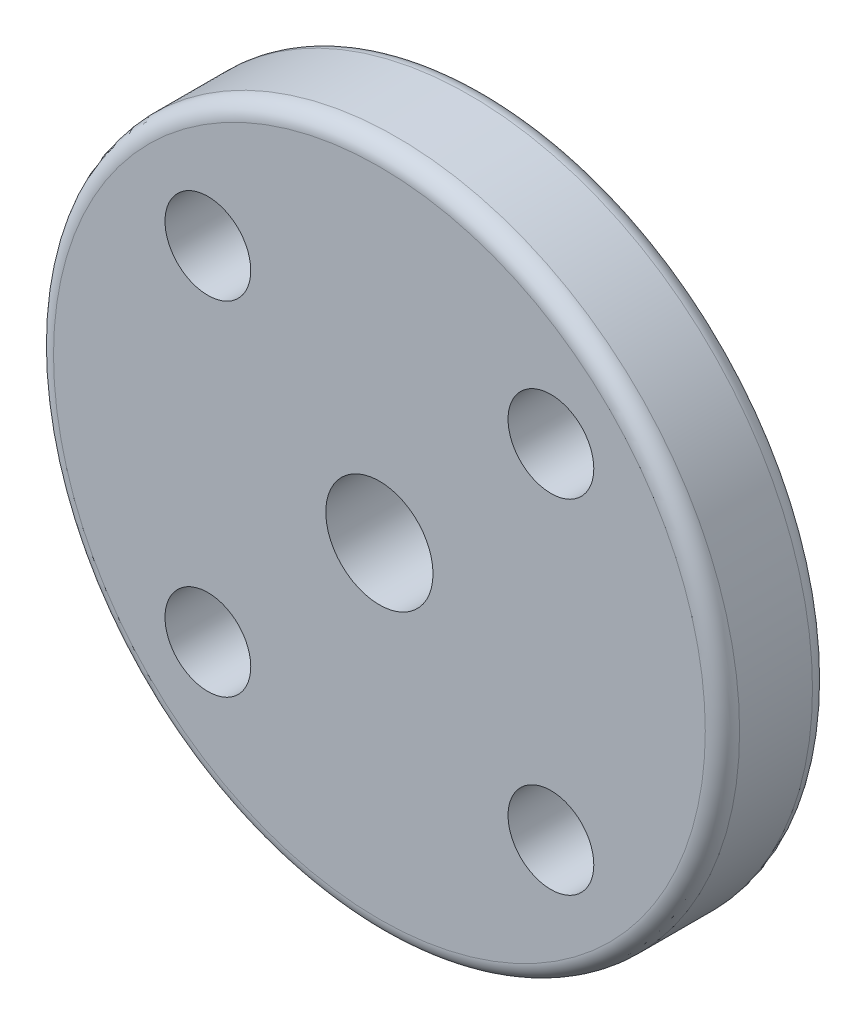
ISO-10303-21;
HEADER;
FILE_DESCRIPTION(('STEP AP214'),'2;1');
FILE_NAME('part.step','',(''),(''),'','','');
FILE_SCHEMA(('AUTOMOTIVE_DESIGN { 1 0 10303 214 1 1 1 1 }'));
ENDSEC;
DATA;
#1=APPLICATION_CONTEXT('core data for automotive mechanical design processes');
#2=APPLICATION_PROTOCOL_DEFINITION('international standard','automotive_design',2000,#1);
#3=PRODUCT_CONTEXT('',#1,'mechanical');
#4=PRODUCT('Part','Part','',(#3));
#5=PRODUCT_RELATED_PRODUCT_CATEGORY('part','',(#4));
#6=PRODUCT_DEFINITION_FORMATION('','',#4);
#7=PRODUCT_DEFINITION_CONTEXT('part definition',#1,'design');
#8=PRODUCT_DEFINITION('design','',#6,#7);
#9=PRODUCT_DEFINITION_SHAPE('','',#8);
#10=(LENGTH_UNIT() NAMED_UNIT(*) SI_UNIT(.MILLI.,.METRE.));
#11=(NAMED_UNIT(*) PLANE_ANGLE_UNIT() SI_UNIT($,.RADIAN.));
#12=(NAMED_UNIT(*) SI_UNIT($,.STERADIAN.) SOLID_ANGLE_UNIT());
#13=UNCERTAINTY_MEASURE_WITH_UNIT(LENGTH_MEASURE(1.E-05),#10,'distance_accuracy_value','');
#14=(GEOMETRIC_REPRESENTATION_CONTEXT(3) GLOBAL_UNCERTAINTY_ASSIGNED_CONTEXT((#13)) GLOBAL_UNIT_ASSIGNED_CONTEXT((#10,
#11,#12)) REPRESENTATION_CONTEXT('',''));
#15=CARTESIAN_POINT('',(0.,0.,0.));
#16=DIRECTION('',(0.,0.,1.));
#17=DIRECTION('',(1.,0.,0.));
#18=AXIS2_PLACEMENT_3D('',#15,#16,#17);
#19=CARTESIAN_POINT('',(0.,0.,5.));
#20=DIRECTION('',(0.,0.,-1.));
#21=DIRECTION('',(-1.,0.,0.));
#22=AXIS2_PLACEMENT_3D('',#19,#20,#21);
#23=CYLINDRICAL_SURFACE('',#22,16.);
#24=CARTESIAN_POINT('',(0.,0.,0.8));
#25=DIRECTION('',(0.,0.,1.));
#26=DIRECTION('',(1.,0.,0.));
#27=AXIS2_PLACEMENT_3D('',#24,#25,#26);
#28=CIRCLE('',#27,16.);
#29=CARTESIAN_POINT('',(16.,0.,0.8));
#30=VERTEX_POINT('',#29);
#31=EDGE_CURVE('E53',#30,#30,#28,.T.);
#32=ORIENTED_EDGE('',*,*,#31,.T.);
#33=EDGE_LOOP('',(#32));
#34=FACE_BOUND('',#33,.T.);
#35=CARTESIAN_POINT('',(0.,0.,4.2));
#36=DIRECTION('',(0.,0.,1.));
#37=DIRECTION('',(1.,0.,0.));
#38=AXIS2_PLACEMENT_3D('',#35,#36,#37);
#39=CIRCLE('',#38,16.);
#40=CARTESIAN_POINT('',(16.,0.,4.2));
#41=VERTEX_POINT('',#40);
#42=EDGE_CURVE('E57',#41,#41,#39,.F.);
#43=ORIENTED_EDGE('',*,*,#42,.T.);
#44=EDGE_LOOP('',(#43));
#45=FACE_BOUND('',#44,.T.);
#46=ADVANCED_FACE('F42',(#34,#45),#23,.T.);
#47=CARTESIAN_POINT('',(-8.,8.,5.));
#48=DIRECTION('',(0.,0.,-1.));
#49=DIRECTION('',(-1.,0.,0.));
#50=AXIS2_PLACEMENT_3D('',#47,#48,#49);
#51=CYLINDRICAL_SURFACE('',#50,2.);
#52=CARTESIAN_POINT('',(-8.,8.,5.));
#53=DIRECTION('',(0.,0.,1.));
#54=DIRECTION('',(1.,0.,0.));
#55=AXIS2_PLACEMENT_3D('',#52,#53,#54);
#56=CIRCLE('',#55,2.);
#57=CARTESIAN_POINT('',(-6.,8.,5.));
#58=VERTEX_POINT('',#57);
#59=EDGE_CURVE('E81',#58,#58,#56,.T.);
#60=ORIENTED_EDGE('',*,*,#59,.T.);
#61=EDGE_LOOP('',(#60));
#62=FACE_BOUND('',#61,.T.);
#63=CARTESIAN_POINT('',(-8.,8.,0.));
#64=DIRECTION('',(0.,0.,1.));
#65=DIRECTION('',(1.,0.,0.));
#66=AXIS2_PLACEMENT_3D('',#63,#64,#65);
#67=CIRCLE('',#66,2.);
#68=CARTESIAN_POINT('',(-6.,8.,0.));
#69=VERTEX_POINT('',#68);
#70=EDGE_CURVE('E67',#69,#69,#67,.T.);
#71=ORIENTED_EDGE('',*,*,#70,.F.);
#72=EDGE_LOOP('',(#71));
#73=FACE_BOUND('',#72,.T.);
#74=ADVANCED_FACE('F124',(#62,#73),#51,.F.);
#75=CARTESIAN_POINT('',(-8.,-8.,5.));
#76=DIRECTION('',(0.,0.,-1.));
#77=DIRECTION('',(-1.,0.,0.));
#78=AXIS2_PLACEMENT_3D('',#75,#76,#77);
#79=CYLINDRICAL_SURFACE('',#78,2.);
#80=CARTESIAN_POINT('',(-8.,-8.,5.));
#81=DIRECTION('',(0.,0.,1.));
#82=DIRECTION('',(1.,0.,0.));
#83=AXIS2_PLACEMENT_3D('',#80,#81,#82);
#84=CIRCLE('',#83,2.);
#85=CARTESIAN_POINT('',(-6.,-8.,5.));
#86=VERTEX_POINT('',#85);
#87=EDGE_CURVE('E84',#86,#86,#84,.T.);
#88=ORIENTED_EDGE('',*,*,#87,.T.);
#89=EDGE_LOOP('',(#88));
#90=FACE_BOUND('',#89,.T.);
#91=CARTESIAN_POINT('',(-8.,-8.,0.));
#92=DIRECTION('',(0.,0.,1.));
#93=DIRECTION('',(1.,0.,0.));
#94=AXIS2_PLACEMENT_3D('',#91,#92,#93);
#95=CIRCLE('',#94,2.);
#96=CARTESIAN_POINT('',(-6.,-8.,0.));
#97=VERTEX_POINT('',#96);
#98=EDGE_CURVE('E70',#97,#97,#95,.T.);
#99=ORIENTED_EDGE('',*,*,#98,.F.);
#100=EDGE_LOOP('',(#99));
#101=FACE_BOUND('',#100,.T.);
#102=ADVANCED_FACE('F130',(#90,#101),#79,.F.);
#103=CARTESIAN_POINT('',(8.,8.,5.));
#104=DIRECTION('',(0.,0.,-1.));
#105=DIRECTION('',(-1.,0.,0.));
#106=AXIS2_PLACEMENT_3D('',#103,#104,#105);
#107=CYLINDRICAL_SURFACE('',#106,2.);
#108=CARTESIAN_POINT('',(8.,8.,5.));
#109=DIRECTION('',(0.,0.,1.));
#110=DIRECTION('',(1.,0.,0.));
#111=AXIS2_PLACEMENT_3D('',#108,#109,#110);
#112=CIRCLE('',#111,2.);
#113=CARTESIAN_POINT('',(10.,8.,5.));
#114=VERTEX_POINT('',#113);
#115=EDGE_CURVE('E87',#114,#114,#112,.T.);
#116=ORIENTED_EDGE('',*,*,#115,.T.);
#117=EDGE_LOOP('',(#116));
#118=FACE_BOUND('',#117,.T.);
#119=CARTESIAN_POINT('',(8.,8.,0.));
#120=DIRECTION('',(0.,0.,1.));
#121=DIRECTION('',(1.,0.,0.));
#122=AXIS2_PLACEMENT_3D('',#119,#120,#121);
#123=CIRCLE('',#122,2.);
#124=CARTESIAN_POINT('',(10.,8.,0.));
#125=VERTEX_POINT('',#124);
#126=EDGE_CURVE('E73',#125,#125,#123,.T.);
#127=ORIENTED_EDGE('',*,*,#126,.F.);
#128=EDGE_LOOP('',(#127));
#129=FACE_BOUND('',#128,.T.);
#130=ADVANCED_FACE('F137',(#118,#129),#107,.F.);
#131=CARTESIAN_POINT('',(8.,-8.,5.));
#132=DIRECTION('',(0.,0.,-1.));
#133=DIRECTION('',(-1.,0.,0.));
#134=AXIS2_PLACEMENT_3D('',#131,#132,#133);
#135=CYLINDRICAL_SURFACE('',#134,2.);
#136=CARTESIAN_POINT('',(8.,-8.,5.));
#137=DIRECTION('',(0.,0.,1.));
#138=DIRECTION('',(1.,0.,0.));
#139=AXIS2_PLACEMENT_3D('',#136,#137,#138);
#140=CIRCLE('',#139,2.);
#141=CARTESIAN_POINT('',(10.,-8.,5.));
#142=VERTEX_POINT('',#141);
#143=EDGE_CURVE('E66',#142,#142,#140,.T.);
#144=ORIENTED_EDGE('',*,*,#143,.T.);
#145=EDGE_LOOP('',(#144));
#146=FACE_BOUND('',#145,.T.);
#147=CARTESIAN_POINT('',(8.,-8.,0.));
#148=DIRECTION('',(0.,0.,1.));
#149=DIRECTION('',(1.,0.,0.));
#150=AXIS2_PLACEMENT_3D('',#147,#148,#149);
#151=CIRCLE('',#150,2.);
#152=CARTESIAN_POINT('',(10.,-8.,0.));
#153=VERTEX_POINT('',#152);
#154=EDGE_CURVE('E76',#153,#153,#151,.T.);
#155=ORIENTED_EDGE('',*,*,#154,.F.);
#156=EDGE_LOOP('',(#155));
#157=FACE_BOUND('',#156,.T.);
#158=ADVANCED_FACE('F93',(#146,#157),#135,.F.);
#159=CARTESIAN_POINT('',(0.,0.,5.));
#160=DIRECTION('',(0.,0.,-1.));
#161=DIRECTION('',(-1.,0.,0.));
#162=AXIS2_PLACEMENT_3D('',#159,#160,#161);
#163=CYLINDRICAL_SURFACE('',#162,2.5);
#164=CARTESIAN_POINT('',(0.,0.,5.));
#165=DIRECTION('',(0.,0.,1.));
#166=DIRECTION('',(1.,0.,0.));
#167=AXIS2_PLACEMENT_3D('',#164,#165,#166);
#168=CIRCLE('',#167,2.5);
#169=CARTESIAN_POINT('',(2.5,0.,5.));
#170=VERTEX_POINT('',#169);
#171=EDGE_CURVE('E62',#170,#170,#168,.T.);
#172=ORIENTED_EDGE('',*,*,#171,.T.);
#173=EDGE_LOOP('',(#172));
#174=FACE_BOUND('',#173,.T.);
#175=CARTESIAN_POINT('',(0.,0.,0.));
#176=DIRECTION('',(0.,0.,1.));
#177=DIRECTION('',(1.,0.,0.));
#178=AXIS2_PLACEMENT_3D('',#175,#176,#177);
#179=CIRCLE('',#178,2.5);
#180=CARTESIAN_POINT('',(2.5,0.,0.));
#181=VERTEX_POINT('',#180);
#182=EDGE_CURVE('E63',#181,#181,#179,.T.);
#183=ORIENTED_EDGE('',*,*,#182,.F.);
#184=EDGE_LOOP('',(#183));
#185=FACE_BOUND('',#184,.T.);
#186=ADVANCED_FACE('F100',(#174,#185),#163,.F.);
#187=CARTESIAN_POINT('',(0.,-35.3414213562373,5.));
#188=DIRECTION('',(0.,0.,1.));
#189=DIRECTION('',(1.,0.,0.));
#190=AXIS2_PLACEMENT_3D('',#187,#188,#189);
#191=PLANE('',#190);
#192=CARTESIAN_POINT('',(0.,0.,5.));
#193=DIRECTION('',(0.,0.,1.));
#194=DIRECTION('',(1.,0.,0.));
#195=AXIS2_PLACEMENT_3D('',#192,#193,#194);
#196=CIRCLE('',#195,15.2);
#197=CARTESIAN_POINT('',(15.2,0.,5.));
#198=VERTEX_POINT('',#197);
#199=EDGE_CURVE('E12',#198,#198,#196,.T.);
#200=ORIENTED_EDGE('',*,*,#199,.T.);
#201=EDGE_LOOP('',(#200));
#202=FACE_BOUND('',#201,.T.);
#203=ORIENTED_EDGE('',*,*,#143,.F.);
#204=EDGE_LOOP('',(#203));
#205=FACE_BOUND('',#204,.T.);
#206=ORIENTED_EDGE('',*,*,#115,.F.);
#207=EDGE_LOOP('',(#206));
#208=FACE_BOUND('',#207,.T.);
#209=ORIENTED_EDGE('',*,*,#87,.F.);
#210=EDGE_LOOP('',(#209));
#211=FACE_BOUND('',#210,.T.);
#212=ORIENTED_EDGE('',*,*,#59,.F.);
#213=EDGE_LOOP('',(#212));
#214=FACE_BOUND('',#213,.T.);
#215=ORIENTED_EDGE('',*,*,#171,.F.);
#216=EDGE_LOOP('',(#215));
#217=FACE_BOUND('',#216,.T.);
#218=ADVANCED_FACE('F96',(#202,#205,#208,#211,#214,#217),#191,.T.);
#219=CARTESIAN_POINT('',(0.,-35.3414213562373,0.));
#220=DIRECTION('',(0.,0.,1.));
#221=DIRECTION('',(1.,0.,0.));
#222=AXIS2_PLACEMENT_3D('',#219,#220,#221);
#223=PLANE('',#222);
#224=CARTESIAN_POINT('',(0.,0.,0.));
#225=DIRECTION('',(0.,0.,1.));
#226=DIRECTION('',(1.,0.,0.));
#227=AXIS2_PLACEMENT_3D('',#224,#225,#226);
#228=CIRCLE('',#227,15.2);
#229=CARTESIAN_POINT('',(15.2,0.,0.));
#230=VERTEX_POINT('',#229);
#231=EDGE_CURVE('E49',#230,#230,#228,.F.);
#232=ORIENTED_EDGE('',*,*,#231,.T.);
#233=EDGE_LOOP('',(#232));
#234=FACE_BOUND('',#233,.T.);
#235=ORIENTED_EDGE('',*,*,#154,.T.);
#236=EDGE_LOOP('',(#235));
#237=FACE_BOUND('',#236,.T.);
#238=ORIENTED_EDGE('',*,*,#126,.T.);
#239=EDGE_LOOP('',(#238));
#240=FACE_BOUND('',#239,.T.);
#241=ORIENTED_EDGE('',*,*,#98,.T.);
#242=EDGE_LOOP('',(#241));
#243=FACE_BOUND('',#242,.T.);
#244=ORIENTED_EDGE('',*,*,#70,.T.);
#245=EDGE_LOOP('',(#244));
#246=FACE_BOUND('',#245,.T.);
#247=ORIENTED_EDGE('',*,*,#182,.T.);
#248=EDGE_LOOP('',(#247));
#249=FACE_BOUND('',#248,.T.);
#250=ADVANCED_FACE('F99',(#234,#237,#240,#243,#246,#249),#223,.F.);
#251=CARTESIAN_POINT('',(0.,0.,0.8));
#252=DIRECTION('',(0.,0.,1.));
#253=DIRECTION('',(1.,0.,0.));
#254=AXIS2_PLACEMENT_3D('',#251,#252,#253);
#255=TOROIDAL_SURFACE('',#254,15.2,0.8);
#256=ORIENTED_EDGE('',*,*,#231,.F.);
#257=EDGE_LOOP('',(#256));
#258=FACE_BOUND('',#257,.T.);
#259=ORIENTED_EDGE('',*,*,#31,.F.);
#260=EDGE_LOOP('',(#259));
#261=FACE_BOUND('',#260,.T.);
#262=ADVANCED_FACE('F116',(#258,#261),#255,.T.);
#263=CARTESIAN_POINT('',(0.,0.,4.2));
#264=DIRECTION('',(0.,0.,1.));
#265=DIRECTION('',(1.,0.,0.));
#266=AXIS2_PLACEMENT_3D('',#263,#264,#265);
#267=TOROIDAL_SURFACE('',#266,15.2,0.8);
#268=ORIENTED_EDGE('',*,*,#42,.F.);
#269=EDGE_LOOP('',(#268));
#270=FACE_BOUND('',#269,.T.);
#271=ORIENTED_EDGE('',*,*,#199,.F.);
#272=EDGE_LOOP('',(#271));
#273=FACE_BOUND('',#272,.T.);
#274=ADVANCED_FACE('F44',(#270,#273),#267,.T.);
#275=CLOSED_SHELL('',(#46,#74,#102,#130,#158,#186,#218,#250,#262,#274));
#276=MANIFOLD_SOLID_BREP('B2',#275);
#277=ADVANCED_BREP_SHAPE_REPRESENTATION('',(#18,#276),#14);
#278=SHAPE_DEFINITION_REPRESENTATION(#9,#277);
ENDSEC;
END-ISO-10303-21;
